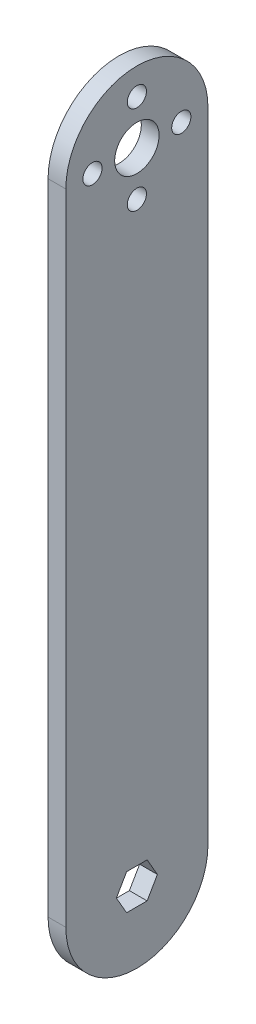
ISO-10303-21;
HEADER;
FILE_DESCRIPTION(('STEP AP214'),'2;1');
FILE_NAME('part.step','',(''),(''),'','','');
FILE_SCHEMA(('AUTOMOTIVE_DESIGN { 1 0 10303 214 1 1 1 1 }'));
ENDSEC;
DATA;
#1=APPLICATION_CONTEXT('core data for automotive mechanical design processes');
#2=APPLICATION_PROTOCOL_DEFINITION('international standard','automotive_design',2000,#1);
#3=PRODUCT_CONTEXT('',#1,'mechanical');
#4=PRODUCT('Part','Part','',(#3));
#5=PRODUCT_RELATED_PRODUCT_CATEGORY('part','',(#4));
#6=PRODUCT_DEFINITION_FORMATION('','',#4);
#7=PRODUCT_DEFINITION_CONTEXT('part definition',#1,'design');
#8=PRODUCT_DEFINITION('design','',#6,#7);
#9=PRODUCT_DEFINITION_SHAPE('','',#8);
#10=(LENGTH_UNIT() NAMED_UNIT(*) SI_UNIT(.MILLI.,.METRE.));
#11=(NAMED_UNIT(*) PLANE_ANGLE_UNIT() SI_UNIT($,.RADIAN.));
#12=(NAMED_UNIT(*) SI_UNIT($,.STERADIAN.) SOLID_ANGLE_UNIT());
#13=UNCERTAINTY_MEASURE_WITH_UNIT(LENGTH_MEASURE(1.E-05),#10,'distance_accuracy_value','');
#14=(GEOMETRIC_REPRESENTATION_CONTEXT(3) GLOBAL_UNCERTAINTY_ASSIGNED_CONTEXT((#13)) GLOBAL_UNIT_ASSIGNED_CONTEXT((#10,
#11,#12)) REPRESENTATION_CONTEXT('',''));
#15=CARTESIAN_POINT('',(0.,0.,0.));
#16=DIRECTION('',(0.,0.,1.));
#17=DIRECTION('',(1.,0.,0.));
#18=AXIS2_PLACEMENT_3D('',#15,#16,#17);
#19=CARTESIAN_POINT('',(6.35,228.6,0.));
#20=DIRECTION('',(1.,0.,0.));
#21=DIRECTION('',(0.,0.,-1.));
#22=AXIS2_PLACEMENT_3D('',#19,#20,#21);
#23=PLANE('',#22);
#24=CARTESIAN_POINT('',(6.35,244.475,0.));
#25=DIRECTION('',(1.,0.,0.));
#26=DIRECTION('',(0.,0.,-1.));
#27=AXIS2_PLACEMENT_3D('',#24,#25,#26);
#28=CIRCLE('',#27,3.42899999999999);
#29=CARTESIAN_POINT('',(6.35,244.475,-3.429));
#30=VERTEX_POINT('',#29);
#31=EDGE_CURVE('E339',#30,#30,#28,.T.);
#32=ORIENTED_EDGE('',*,*,#31,.F.);
#33=EDGE_LOOP('',(#32));
#34=FACE_BOUND('',#33,.T.);
#35=CARTESIAN_POINT('',(6.35,212.725,0.));
#36=DIRECTION('',(1.,0.,0.));
#37=DIRECTION('',(0.,0.,-1.));
#38=AXIS2_PLACEMENT_3D('',#35,#36,#37);
#39=CIRCLE('',#38,3.429);
#40=CARTESIAN_POINT('',(6.35,212.725,-3.429));
#41=VERTEX_POINT('',#40);
#42=EDGE_CURVE('E163',#41,#41,#39,.T.);
#43=ORIENTED_EDGE('',*,*,#42,.F.);
#44=EDGE_LOOP('',(#43));
#45=FACE_BOUND('',#44,.T.);
#46=CARTESIAN_POINT('',(6.35,228.6,0.));
#47=DIRECTION('',(1.,0.,0.));
#48=DIRECTION('',(0.,0.,-1.));
#49=AXIS2_PLACEMENT_3D('',#46,#47,#48);
#50=CIRCLE('',#49,25.4);
#51=CARTESIAN_POINT('',(6.35,228.6,-25.4));
#52=VERTEX_POINT('',#51);
#53=CARTESIAN_POINT('',(6.35,228.6,25.4));
#54=VERTEX_POINT('',#53);
#55=EDGE_CURVE('E201',#52,#54,#50,.T.);
#56=ORIENTED_EDGE('',*,*,#55,.T.);
#57=DIRECTION('',(0.,-1.,0.));
#58=VECTOR('',#57,1.);
#59=CARTESIAN_POINT('',(6.35,228.6,25.4));
#60=LINE('',#59,#58);
#61=CARTESIAN_POINT('',(6.35,0.,25.4));
#62=VERTEX_POINT('',#61);
#63=EDGE_CURVE('E205',#54,#62,#60,.T.);
#64=ORIENTED_EDGE('',*,*,#63,.T.);
#65=CARTESIAN_POINT('',(6.35,0.,0.));
#66=DIRECTION('',(1.,0.,0.));
#67=DIRECTION('',(0.,0.,-1.));
#68=AXIS2_PLACEMENT_3D('',#65,#66,#67);
#69=CIRCLE('',#68,25.4);
#70=CARTESIAN_POINT('',(6.35,0.,-25.4));
#71=VERTEX_POINT('',#70);
#72=EDGE_CURVE('E209',#62,#71,#69,.T.);
#73=ORIENTED_EDGE('',*,*,#72,.T.);
#74=DIRECTION('',(0.,1.,0.));
#75=VECTOR('',#74,1.);
#76=CARTESIAN_POINT('',(6.35,228.6,-25.4));
#77=LINE('',#76,#75);
#78=EDGE_CURVE('E212',#71,#52,#77,.T.);
#79=ORIENTED_EDGE('',*,*,#78,.T.);
#80=EDGE_LOOP('',(#56,#64,#73,#79));
#81=FACE_BOUND('',#80,.T.);
#82=CARTESIAN_POINT('',(6.35,228.6,0.));
#83=DIRECTION('',(1.,0.,0.));
#84=DIRECTION('',(0.,0.,-1.));
#85=AXIS2_PLACEMENT_3D('',#82,#83,#84);
#86=CIRCLE('',#85,7.93749999999999);
#87=CARTESIAN_POINT('',(6.35,228.6,-7.93749999999999));
#88=VERTEX_POINT('',#87);
#89=EDGE_CURVE('E193',#88,#88,#86,.T.);
#90=ORIENTED_EDGE('',*,*,#89,.F.);
#91=EDGE_LOOP('',(#90));
#92=FACE_BOUND('',#91,.T.);
#93=DIRECTION('',(0.,0.866025403784436,0.500000000000005));
#94=VECTOR('',#93,1.);
#95=CARTESIAN_POINT('',(6.35,0.,-7.33234841870825));
#96=LINE('',#95,#94);
#97=CARTESIAN_POINT('',(6.35,0.,-7.33234841870825));
#98=VERTEX_POINT('',#97);
#99=CARTESIAN_POINT('',(6.35,6.34999999999998,-3.66617420935409));
#100=VERTEX_POINT('',#99);
#101=EDGE_CURVE('E130',#98,#100,#96,.T.);
#102=ORIENTED_EDGE('',*,*,#101,.F.);
#103=DIRECTION('',(0.,0.866025403784439,-0.499999999999999));
#104=VECTOR('',#103,1.);
#105=CARTESIAN_POINT('',(6.35,-6.35,-3.66617420935412));
#106=LINE('',#105,#104);
#107=CARTESIAN_POINT('',(6.35,-6.35,-3.66617420935412));
#108=VERTEX_POINT('',#107);
#109=EDGE_CURVE('E121',#108,#98,#106,.T.);
#110=ORIENTED_EDGE('',*,*,#109,.F.);
#111=DIRECTION('',(0.,0.,-1.));
#112=VECTOR('',#111,1.);
#113=CARTESIAN_POINT('',(6.35,-6.35,3.66617420935405));
#114=LINE('',#113,#112);
#115=CARTESIAN_POINT('',(6.35,-6.34999999999999,3.66617420935405));
#116=VERTEX_POINT('',#115);
#117=EDGE_CURVE('E158',#116,#108,#114,.T.);
#118=ORIENTED_EDGE('',*,*,#117,.F.);
#119=DIRECTION('',(0.,-0.866025403784435,-0.500000000000007));
#120=VECTOR('',#119,1.);
#121=CARTESIAN_POINT('',(6.35,0.,7.33234841870821));
#122=LINE('',#121,#120);
#123=CARTESIAN_POINT('',(6.35,0.,7.33234841870821));
#124=VERTEX_POINT('',#123);
#125=EDGE_CURVE('E155',#124,#116,#122,.T.);
#126=ORIENTED_EDGE('',*,*,#125,.F.);
#127=DIRECTION('',(0.,-0.866025403784441,0.499999999999995));
#128=VECTOR('',#127,1.);
#129=CARTESIAN_POINT('',(6.35,6.34999999999995,3.66617420935413));
#130=LINE('',#129,#128);
#131=CARTESIAN_POINT('',(6.35,6.34999999999995,3.66617420935413));
#132=VERTEX_POINT('',#131);
#133=EDGE_CURVE('E149',#132,#124,#130,.T.);
#134=ORIENTED_EDGE('',*,*,#133,.F.);
#135=DIRECTION('',(0.,0.,1.));
#136=VECTOR('',#135,1.);
#137=CARTESIAN_POINT('',(6.35,6.34999999999998,-3.66617420935409));
#138=LINE('',#137,#136);
#139=EDGE_CURVE('E145',#100,#132,#138,.T.);
#140=ORIENTED_EDGE('',*,*,#139,.F.);
#141=EDGE_LOOP('',(#102,#110,#118,#126,#134,#140));
#142=FACE_BOUND('',#141,.T.);
#143=CARTESIAN_POINT('',(6.35,228.6,15.875));
#144=DIRECTION('',(1.,0.,0.));
#145=DIRECTION('',(0.,0.,-1.));
#146=AXIS2_PLACEMENT_3D('',#143,#144,#145);
#147=CIRCLE('',#146,3.42899999999999);
#148=CARTESIAN_POINT('',(6.35,228.6,12.446));
#149=VERTEX_POINT('',#148);
#150=EDGE_CURVE('E347',#149,#149,#147,.T.);
#151=ORIENTED_EDGE('',*,*,#150,.F.);
#152=EDGE_LOOP('',(#151));
#153=FACE_BOUND('',#152,.T.);
#154=CARTESIAN_POINT('',(6.35,228.6,-15.875));
#155=DIRECTION('',(1.,0.,0.));
#156=DIRECTION('',(0.,0.,-1.));
#157=AXIS2_PLACEMENT_3D('',#154,#155,#156);
#158=CIRCLE('',#157,3.42900000000001);
#159=CARTESIAN_POINT('',(6.35,228.6,-19.304));
#160=VERTEX_POINT('',#159);
#161=EDGE_CURVE('E328',#160,#160,#158,.T.);
#162=ORIENTED_EDGE('',*,*,#161,.F.);
#163=EDGE_LOOP('',(#162));
#164=FACE_BOUND('',#163,.T.);
#165=ADVANCED_FACE('F43',(#34,#45,#81,#92,#142,#153,#164),#23,.T.);
#166=CARTESIAN_POINT('',(0.,228.6,0.));
#167=DIRECTION('',(1.,0.,0.));
#168=DIRECTION('',(0.,0.,-1.));
#169=AXIS2_PLACEMENT_3D('',#166,#167,#168);
#170=PLANE('',#169);
#171=CARTESIAN_POINT('',(0.,228.6,0.));
#172=DIRECTION('',(1.,0.,0.));
#173=DIRECTION('',(0.,0.,-1.));
#174=AXIS2_PLACEMENT_3D('',#171,#172,#173);
#175=CIRCLE('',#174,7.93749999999999);
#176=CARTESIAN_POINT('',(0.,228.6,-7.93749999999999));
#177=VERTEX_POINT('',#176);
#178=EDGE_CURVE('E139',#177,#177,#175,.T.);
#179=ORIENTED_EDGE('',*,*,#178,.T.);
#180=EDGE_LOOP('',(#179));
#181=FACE_BOUND('',#180,.T.);
#182=CARTESIAN_POINT('',(0.,228.6,0.));
#183=DIRECTION('',(1.,0.,0.));
#184=DIRECTION('',(0.,0.,-1.));
#185=AXIS2_PLACEMENT_3D('',#182,#183,#184);
#186=CIRCLE('',#185,25.4);
#187=CARTESIAN_POINT('',(0.,228.6,-25.4));
#188=VERTEX_POINT('',#187);
#189=CARTESIAN_POINT('',(0.,228.6,25.4));
#190=VERTEX_POINT('',#189);
#191=EDGE_CURVE('E197',#188,#190,#186,.T.);
#192=ORIENTED_EDGE('',*,*,#191,.F.);
#193=DIRECTION('',(0.,1.,0.));
#194=VECTOR('',#193,1.);
#195=CARTESIAN_POINT('',(0.,228.6,-25.4));
#196=LINE('',#195,#194);
#197=CARTESIAN_POINT('',(0.,0.,-25.4));
#198=VERTEX_POINT('',#197);
#199=EDGE_CURVE('E206',#198,#188,#196,.T.);
#200=ORIENTED_EDGE('',*,*,#199,.F.);
#201=CARTESIAN_POINT('',(0.,0.,0.));
#202=DIRECTION('',(1.,0.,0.));
#203=DIRECTION('',(0.,0.,-1.));
#204=AXIS2_PLACEMENT_3D('',#201,#202,#203);
#205=CIRCLE('',#204,25.4);
#206=CARTESIAN_POINT('',(0.,0.,25.4));
#207=VERTEX_POINT('',#206);
#208=EDGE_CURVE('E222',#207,#198,#205,.T.);
#209=ORIENTED_EDGE('',*,*,#208,.F.);
#210=DIRECTION('',(0.,-1.,0.));
#211=VECTOR('',#210,1.);
#212=CARTESIAN_POINT('',(0.,228.6,25.4));
#213=LINE('',#212,#211);
#214=EDGE_CURVE('E219',#190,#207,#213,.T.);
#215=ORIENTED_EDGE('',*,*,#214,.F.);
#216=EDGE_LOOP('',(#192,#200,#209,#215));
#217=FACE_BOUND('',#216,.T.);
#218=DIRECTION('',(0.,0.866025403784439,-0.499999999999999));
#219=VECTOR('',#218,1.);
#220=CARTESIAN_POINT('',(0.,-6.35,-3.66617420935412));
#221=LINE('',#220,#219);
#222=CARTESIAN_POINT('',(0.,-6.35,-3.66617420935412));
#223=VERTEX_POINT('',#222);
#224=CARTESIAN_POINT('',(0.,0.,-7.33234841870825));
#225=VERTEX_POINT('',#224);
#226=EDGE_CURVE('E67',#223,#225,#221,.T.);
#227=ORIENTED_EDGE('',*,*,#226,.T.);
#228=DIRECTION('',(0.,0.866025403784436,0.500000000000005));
#229=VECTOR('',#228,1.);
#230=CARTESIAN_POINT('',(0.,0.,-7.33234841870825));
#231=LINE('',#230,#229);
#232=CARTESIAN_POINT('',(0.,6.34999999999998,-3.66617420935409));
#233=VERTEX_POINT('',#232);
#234=EDGE_CURVE('E137',#225,#233,#231,.T.);
#235=ORIENTED_EDGE('',*,*,#234,.T.);
#236=DIRECTION('',(0.,0.,1.));
#237=VECTOR('',#236,1.);
#238=CARTESIAN_POINT('',(0.,6.34999999999998,-3.66617420935409));
#239=LINE('',#238,#237);
#240=CARTESIAN_POINT('',(0.,6.34999999999995,3.66617420935413));
#241=VERTEX_POINT('',#240);
#242=EDGE_CURVE('E166',#233,#241,#239,.T.);
#243=ORIENTED_EDGE('',*,*,#242,.T.);
#244=DIRECTION('',(0.,-0.866025403784441,0.499999999999995));
#245=VECTOR('',#244,1.);
#246=CARTESIAN_POINT('',(0.,6.34999999999995,3.66617420935413));
#247=LINE('',#246,#245);
#248=CARTESIAN_POINT('',(0.,0.,7.33234841870821));
#249=VERTEX_POINT('',#248);
#250=EDGE_CURVE('E170',#241,#249,#247,.T.);
#251=ORIENTED_EDGE('',*,*,#250,.T.);
#252=DIRECTION('',(0.,-0.866025403784435,-0.500000000000007));
#253=VECTOR('',#252,1.);
#254=CARTESIAN_POINT('',(0.,0.,7.33234841870821));
#255=LINE('',#254,#253);
#256=CARTESIAN_POINT('',(0.,-6.35,3.66617420935405));
#257=VERTEX_POINT('',#256);
#258=EDGE_CURVE('E174',#249,#257,#255,.T.);
#259=ORIENTED_EDGE('',*,*,#258,.T.);
#260=DIRECTION('',(0.,0.,-1.));
#261=VECTOR('',#260,1.);
#262=CARTESIAN_POINT('',(0.,-6.35,3.66617420935405));
#263=LINE('',#262,#261);
#264=EDGE_CURVE('E131',#257,#223,#263,.T.);
#265=ORIENTED_EDGE('',*,*,#264,.T.);
#266=EDGE_LOOP('',(#227,#235,#243,#251,#259,#265));
#267=FACE_BOUND('',#266,.T.);
#268=CARTESIAN_POINT('',(0.,212.725,0.));
#269=DIRECTION('',(1.,0.,0.));
#270=DIRECTION('',(0.,0.,-1.));
#271=AXIS2_PLACEMENT_3D('',#268,#269,#270);
#272=CIRCLE('',#271,3.429);
#273=CARTESIAN_POINT('',(0.,212.725,-3.429));
#274=VERTEX_POINT('',#273);
#275=EDGE_CURVE('E351',#274,#274,#272,.T.);
#276=ORIENTED_EDGE('',*,*,#275,.T.);
#277=EDGE_LOOP('',(#276));
#278=FACE_BOUND('',#277,.T.);
#279=CARTESIAN_POINT('',(0.,228.6,15.875));
#280=DIRECTION('',(1.,0.,0.));
#281=DIRECTION('',(0.,0.,-1.));
#282=AXIS2_PLACEMENT_3D('',#279,#280,#281);
#283=CIRCLE('',#282,3.42899999999999);
#284=CARTESIAN_POINT('',(0.,228.6,12.446));
#285=VERTEX_POINT('',#284);
#286=EDGE_CURVE('E343',#285,#285,#283,.T.);
#287=ORIENTED_EDGE('',*,*,#286,.T.);
#288=EDGE_LOOP('',(#287));
#289=FACE_BOUND('',#288,.T.);
#290=CARTESIAN_POINT('',(0.,244.475,0.));
#291=DIRECTION('',(1.,0.,0.));
#292=DIRECTION('',(0.,0.,-1.));
#293=AXIS2_PLACEMENT_3D('',#290,#291,#292);
#294=CIRCLE('',#293,3.42899999999999);
#295=CARTESIAN_POINT('',(0.,244.475,-3.429));
#296=VERTEX_POINT('',#295);
#297=EDGE_CURVE('E336',#296,#296,#294,.T.);
#298=ORIENTED_EDGE('',*,*,#297,.T.);
#299=EDGE_LOOP('',(#298));
#300=FACE_BOUND('',#299,.T.);
#301=CARTESIAN_POINT('',(0.,228.6,-15.875));
#302=DIRECTION('',(1.,0.,0.));
#303=DIRECTION('',(0.,0.,-1.));
#304=AXIS2_PLACEMENT_3D('',#301,#302,#303);
#305=CIRCLE('',#304,3.42900000000001);
#306=CARTESIAN_POINT('',(0.,228.6,-19.304));
#307=VERTEX_POINT('',#306);
#308=EDGE_CURVE('E331',#307,#307,#305,.T.);
#309=ORIENTED_EDGE('',*,*,#308,.T.);
#310=EDGE_LOOP('',(#309));
#311=FACE_BOUND('',#310,.T.);
#312=ADVANCED_FACE('F245',(#181,#217,#267,#278,#289,#300,#311),#170,.F.);
#313=CARTESIAN_POINT('',(6.35,228.6,0.));
#314=DIRECTION('',(-1.,0.,0.));
#315=DIRECTION('',(0.,0.,1.));
#316=AXIS2_PLACEMENT_3D('',#313,#314,#315);
#317=CYLINDRICAL_SURFACE('',#316,25.4);
#318=ORIENTED_EDGE('',*,*,#191,.T.);
#319=DIRECTION('',(-1.,0.,0.));
#320=VECTOR('',#319,1.);
#321=CARTESIAN_POINT('',(6.35,228.6,25.4));
#322=LINE('',#321,#320);
#323=EDGE_CURVE('E11',#54,#190,#322,.T.);
#324=ORIENTED_EDGE('',*,*,#323,.F.);
#325=ORIENTED_EDGE('',*,*,#55,.F.);
#326=DIRECTION('',(-1.,0.,0.));
#327=VECTOR('',#326,1.);
#328=CARTESIAN_POINT('',(6.35,228.6,-25.4));
#329=LINE('',#328,#327);
#330=EDGE_CURVE('E215',#52,#188,#329,.T.);
#331=ORIENTED_EDGE('',*,*,#330,.T.);
#332=EDGE_LOOP('',(#318,#324,#325,#331));
#333=FACE_BOUND('',#332,.T.);
#334=ADVANCED_FACE('F45',(#333),#317,.T.);
#335=CARTESIAN_POINT('',(6.35,228.6,25.4));
#336=DIRECTION('',(0.,0.,-1.));
#337=DIRECTION('',(0.,1.,0.));
#338=AXIS2_PLACEMENT_3D('',#335,#336,#337);
#339=PLANE('',#338);
#340=ORIENTED_EDGE('',*,*,#214,.T.);
#341=DIRECTION('',(-1.,0.,0.));
#342=VECTOR('',#341,1.);
#343=CARTESIAN_POINT('',(6.35,0.,25.4));
#344=LINE('',#343,#342);
#345=EDGE_CURVE('E52',#62,#207,#344,.T.);
#346=ORIENTED_EDGE('',*,*,#345,.F.);
#347=ORIENTED_EDGE('',*,*,#63,.F.);
#348=ORIENTED_EDGE('',*,*,#323,.T.);
#349=EDGE_LOOP('',(#340,#346,#347,#348));
#350=FACE_BOUND('',#349,.T.);
#351=ADVANCED_FACE('F256',(#350),#339,.F.);
#352=CARTESIAN_POINT('',(6.35,0.,0.));
#353=DIRECTION('',(-1.,0.,0.));
#354=DIRECTION('',(0.,0.,1.));
#355=AXIS2_PLACEMENT_3D('',#352,#353,#354);
#356=CYLINDRICAL_SURFACE('',#355,25.4);
#357=ORIENTED_EDGE('',*,*,#208,.T.);
#358=DIRECTION('',(-1.,0.,0.));
#359=VECTOR('',#358,1.);
#360=CARTESIAN_POINT('',(6.35,0.,-25.4));
#361=LINE('',#360,#359);
#362=EDGE_CURVE('E230',#71,#198,#361,.T.);
#363=ORIENTED_EDGE('',*,*,#362,.F.);
#364=ORIENTED_EDGE('',*,*,#72,.F.);
#365=ORIENTED_EDGE('',*,*,#345,.T.);
#366=EDGE_LOOP('',(#357,#363,#364,#365));
#367=FACE_BOUND('',#366,.T.);
#368=ADVANCED_FACE('F239',(#367),#356,.T.);
#369=CARTESIAN_POINT('',(6.35,228.6,-25.4));
#370=DIRECTION('',(0.,0.,1.));
#371=DIRECTION('',(0.,-1.,0.));
#372=AXIS2_PLACEMENT_3D('',#369,#370,#371);
#373=PLANE('',#372);
#374=ORIENTED_EDGE('',*,*,#199,.T.);
#375=ORIENTED_EDGE('',*,*,#330,.F.);
#376=ORIENTED_EDGE('',*,*,#78,.F.);
#377=ORIENTED_EDGE('',*,*,#362,.T.);
#378=EDGE_LOOP('',(#374,#375,#376,#377));
#379=FACE_BOUND('',#378,.T.);
#380=ADVANCED_FACE('F249',(#379),#373,.F.);
#381=CARTESIAN_POINT('',(6.35,228.6,0.));
#382=DIRECTION('',(-1.,0.,0.));
#383=DIRECTION('',(0.,0.,1.));
#384=AXIS2_PLACEMENT_3D('',#381,#382,#383);
#385=CYLINDRICAL_SURFACE('',#384,7.93749999999999);
#386=ORIENTED_EDGE('',*,*,#89,.T.);
#387=EDGE_LOOP('',(#386));
#388=FACE_BOUND('',#387,.T.);
#389=ORIENTED_EDGE('',*,*,#178,.F.);
#390=EDGE_LOOP('',(#389));
#391=FACE_BOUND('',#390,.T.);
#392=ADVANCED_FACE('F274',(#388,#391),#385,.F.);
#393=CARTESIAN_POINT('',(6.35,-6.35,-3.66617420935412));
#394=DIRECTION('',(0.,0.499999999999999,0.866025403784439));
#395=DIRECTION('',(0.,-0.866025403784439,0.499999999999999));
#396=AXIS2_PLACEMENT_3D('',#393,#394,#395);
#397=PLANE('',#396);
#398=ORIENTED_EDGE('',*,*,#226,.F.);
#399=DIRECTION('',(-1.,0.,0.));
#400=VECTOR('',#399,1.);
#401=CARTESIAN_POINT('',(6.35,-6.35,-3.66617420935412));
#402=LINE('',#401,#400);
#403=EDGE_CURVE('E125',#108,#223,#402,.T.);
#404=ORIENTED_EDGE('',*,*,#403,.F.);
#405=ORIENTED_EDGE('',*,*,#109,.T.);
#406=DIRECTION('',(-1.,0.,0.));
#407=VECTOR('',#406,1.);
#408=CARTESIAN_POINT('',(6.35,0.,-7.33234841870825));
#409=LINE('',#408,#407);
#410=EDGE_CURVE('E124',#98,#225,#409,.T.);
#411=ORIENTED_EDGE('',*,*,#410,.T.);
#412=EDGE_LOOP('',(#398,#404,#405,#411));
#413=FACE_BOUND('',#412,.T.);
#414=ADVANCED_FACE('F123',(#413),#397,.T.);
#415=CARTESIAN_POINT('',(6.35,0.,-7.33234841870825));
#416=DIRECTION('',(0.,-0.500000000000005,0.866025403784436));
#417=DIRECTION('',(0.,-0.866025403784436,-0.500000000000005));
#418=AXIS2_PLACEMENT_3D('',#415,#416,#417);
#419=PLANE('',#418);
#420=ORIENTED_EDGE('',*,*,#234,.F.);
#421=ORIENTED_EDGE('',*,*,#410,.F.);
#422=ORIENTED_EDGE('',*,*,#101,.T.);
#423=DIRECTION('',(-1.,0.,0.));
#424=VECTOR('',#423,1.);
#425=CARTESIAN_POINT('',(6.35,6.34999999999998,-3.66617420935409));
#426=LINE('',#425,#424);
#427=EDGE_CURVE('E140',#100,#233,#426,.T.);
#428=ORIENTED_EDGE('',*,*,#427,.T.);
#429=EDGE_LOOP('',(#420,#421,#422,#428));
#430=FACE_BOUND('',#429,.T.);
#431=ADVANCED_FACE('F134',(#430),#419,.T.);
#432=CARTESIAN_POINT('',(6.35,6.34999999999998,-3.66617420935409));
#433=DIRECTION('',(0.,-1.,0.));
#434=DIRECTION('',(0.,0.,-1.));
#435=AXIS2_PLACEMENT_3D('',#432,#433,#434);
#436=PLANE('',#435);
#437=ORIENTED_EDGE('',*,*,#242,.F.);
#438=ORIENTED_EDGE('',*,*,#427,.F.);
#439=ORIENTED_EDGE('',*,*,#139,.T.);
#440=DIRECTION('',(-1.,0.,0.));
#441=VECTOR('',#440,1.);
#442=CARTESIAN_POINT('',(6.35,6.34999999999995,3.66617420935413));
#443=LINE('',#442,#441);
#444=EDGE_CURVE('E188',#132,#241,#443,.T.);
#445=ORIENTED_EDGE('',*,*,#444,.T.);
#446=EDGE_LOOP('',(#437,#438,#439,#445));
#447=FACE_BOUND('',#446,.T.);
#448=ADVANCED_FACE('F291',(#447),#436,.T.);
#449=CARTESIAN_POINT('',(6.35,6.34999999999995,3.66617420935413));
#450=DIRECTION('',(0.,-0.499999999999995,-0.866025403784442));
#451=DIRECTION('',(0.,0.866025403784442,-0.499999999999995));
#452=AXIS2_PLACEMENT_3D('',#449,#450,#451);
#453=PLANE('',#452);
#454=ORIENTED_EDGE('',*,*,#250,.F.);
#455=ORIENTED_EDGE('',*,*,#444,.F.);
#456=ORIENTED_EDGE('',*,*,#133,.T.);
#457=DIRECTION('',(-1.,0.,0.));
#458=VECTOR('',#457,1.);
#459=CARTESIAN_POINT('',(6.35,0.,7.33234841870821));
#460=LINE('',#459,#458);
#461=EDGE_CURVE('E185',#124,#249,#460,.T.);
#462=ORIENTED_EDGE('',*,*,#461,.T.);
#463=EDGE_LOOP('',(#454,#455,#456,#462));
#464=FACE_BOUND('',#463,.T.);
#465=ADVANCED_FACE('F296',(#464),#453,.T.);
#466=CARTESIAN_POINT('',(6.35,0.,7.33234841870821));
#467=DIRECTION('',(0.,0.500000000000007,-0.866025403784434));
#468=DIRECTION('',(0.,0.866025403784435,0.500000000000007));
#469=AXIS2_PLACEMENT_3D('',#466,#467,#468);
#470=PLANE('',#469);
#471=ORIENTED_EDGE('',*,*,#258,.F.);
#472=ORIENTED_EDGE('',*,*,#461,.F.);
#473=ORIENTED_EDGE('',*,*,#125,.T.);
#474=DIRECTION('',(-1.,0.,0.));
#475=VECTOR('',#474,1.);
#476=CARTESIAN_POINT('',(6.35,-6.35,3.66617420935405));
#477=LINE('',#476,#475);
#478=EDGE_CURVE('E59',#116,#257,#477,.T.);
#479=ORIENTED_EDGE('',*,*,#478,.T.);
#480=EDGE_LOOP('',(#471,#472,#473,#479));
#481=FACE_BOUND('',#480,.T.);
#482=ADVANCED_FACE('F300',(#481),#470,.T.);
#483=CARTESIAN_POINT('',(6.35,-6.35,3.66617420935405));
#484=DIRECTION('',(0.,1.,0.));
#485=DIRECTION('',(0.,0.,1.));
#486=AXIS2_PLACEMENT_3D('',#483,#484,#485);
#487=PLANE('',#486);
#488=ORIENTED_EDGE('',*,*,#264,.F.);
#489=ORIENTED_EDGE('',*,*,#478,.F.);
#490=ORIENTED_EDGE('',*,*,#117,.T.);
#491=ORIENTED_EDGE('',*,*,#403,.T.);
#492=EDGE_LOOP('',(#488,#489,#490,#491));
#493=FACE_BOUND('',#492,.T.);
#494=ADVANCED_FACE('F304',(#493),#487,.T.);
#495=CARTESIAN_POINT('',(6.35,212.725,0.));
#496=DIRECTION('',(-1.,0.,0.));
#497=DIRECTION('',(0.,0.,1.));
#498=AXIS2_PLACEMENT_3D('',#495,#496,#497);
#499=CYLINDRICAL_SURFACE('',#498,3.429);
#500=ORIENTED_EDGE('',*,*,#42,.T.);
#501=EDGE_LOOP('',(#500));
#502=FACE_BOUND('',#501,.T.);
#503=ORIENTED_EDGE('',*,*,#275,.F.);
#504=EDGE_LOOP('',(#503));
#505=FACE_BOUND('',#504,.T.);
#506=ADVANCED_FACE('F308',(#502,#505),#499,.F.);
#507=CARTESIAN_POINT('',(6.35,228.6,15.875));
#508=DIRECTION('',(-1.,0.,0.));
#509=DIRECTION('',(0.,0.,1.));
#510=AXIS2_PLACEMENT_3D('',#507,#508,#509);
#511=CYLINDRICAL_SURFACE('',#510,3.42899999999999);
#512=ORIENTED_EDGE('',*,*,#150,.T.);
#513=EDGE_LOOP('',(#512));
#514=FACE_BOUND('',#513,.T.);
#515=ORIENTED_EDGE('',*,*,#286,.F.);
#516=EDGE_LOOP('',(#515));
#517=FACE_BOUND('',#516,.T.);
#518=ADVANCED_FACE('F311',(#514,#517),#511,.F.);
#519=CARTESIAN_POINT('',(6.35,244.475,0.));
#520=DIRECTION('',(-1.,0.,0.));
#521=DIRECTION('',(0.,0.,1.));
#522=AXIS2_PLACEMENT_3D('',#519,#520,#521);
#523=CYLINDRICAL_SURFACE('',#522,3.42899999999999);
#524=ORIENTED_EDGE('',*,*,#31,.T.);
#525=EDGE_LOOP('',(#524));
#526=FACE_BOUND('',#525,.T.);
#527=ORIENTED_EDGE('',*,*,#297,.F.);
#528=EDGE_LOOP('',(#527));
#529=FACE_BOUND('',#528,.T.);
#530=ADVANCED_FACE('F315',(#526,#529),#523,.F.);
#531=CARTESIAN_POINT('',(6.35,228.6,-15.875));
#532=DIRECTION('',(-1.,0.,0.));
#533=DIRECTION('',(0.,0.,1.));
#534=AXIS2_PLACEMENT_3D('',#531,#532,#533);
#535=CYLINDRICAL_SURFACE('',#534,3.42900000000001);
#536=ORIENTED_EDGE('',*,*,#161,.T.);
#537=EDGE_LOOP('',(#536));
#538=FACE_BOUND('',#537,.T.);
#539=ORIENTED_EDGE('',*,*,#308,.F.);
#540=EDGE_LOOP('',(#539));
#541=FACE_BOUND('',#540,.T.);
#542=ADVANCED_FACE('F319',(#538,#541),#535,.F.);
#543=CLOSED_SHELL('',(#165,#312,#334,#351,#368,#380,#392,#414,#431,#448,#465,#482,#494,#506,
#518,#530,#542));
#544=MANIFOLD_SOLID_BREP('B2',#543);
#545=ADVANCED_BREP_SHAPE_REPRESENTATION('',(#18,#544),#14);
#546=SHAPE_DEFINITION_REPRESENTATION(#9,#545);
ENDSEC;
END-ISO-10303-21;
